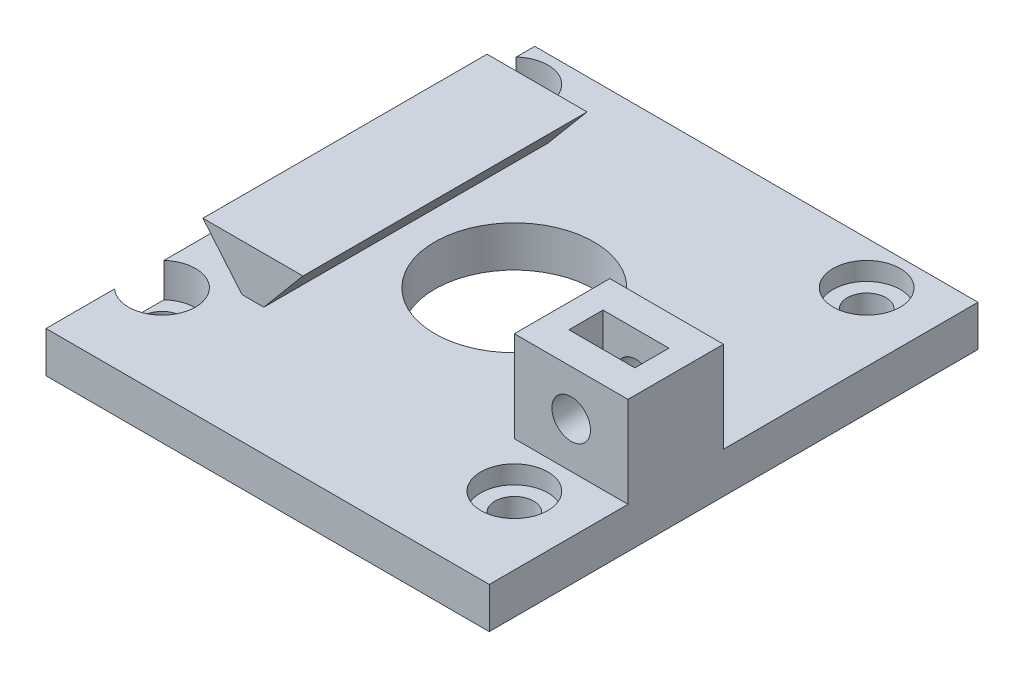
ISO-10303-21;
HEADER;
FILE_DESCRIPTION(('STEP AP214'),'2;1');
FILE_NAME('part.step','',(''),(''),'','','');
FILE_SCHEMA(('AUTOMOTIVE_DESIGN { 1 0 10303 214 1 1 1 1 }'));
ENDSEC;
DATA;
#1=APPLICATION_CONTEXT('core data for automotive mechanical design processes');
#2=APPLICATION_PROTOCOL_DEFINITION('international standard','automotive_design',2000,#1);
#3=PRODUCT_CONTEXT('',#1,'mechanical');
#4=PRODUCT('Part','Part','',(#3));
#5=PRODUCT_RELATED_PRODUCT_CATEGORY('part','',(#4));
#6=PRODUCT_DEFINITION_FORMATION('','',#4);
#7=PRODUCT_DEFINITION_CONTEXT('part definition',#1,'design');
#8=PRODUCT_DEFINITION('design','',#6,#7);
#9=PRODUCT_DEFINITION_SHAPE('','',#8);
#10=(LENGTH_UNIT() NAMED_UNIT(*) SI_UNIT(.MILLI.,.METRE.));
#11=(NAMED_UNIT(*) PLANE_ANGLE_UNIT() SI_UNIT($,.RADIAN.));
#12=(NAMED_UNIT(*) SI_UNIT($,.STERADIAN.) SOLID_ANGLE_UNIT());
#13=UNCERTAINTY_MEASURE_WITH_UNIT(LENGTH_MEASURE(1.E-05),#10,'distance_accuracy_value','');
#14=(GEOMETRIC_REPRESENTATION_CONTEXT(3) GLOBAL_UNCERTAINTY_ASSIGNED_CONTEXT((#13)) GLOBAL_UNIT_ASSIGNED_CONTEXT((#10,
#11,#12)) REPRESENTATION_CONTEXT('',''));
#15=CARTESIAN_POINT('',(0.,0.,0.));
#16=DIRECTION('',(0.,0.,1.));
#17=DIRECTION('',(1.,0.,0.));
#18=AXIS2_PLACEMENT_3D('',#15,#16,#17);
#19=CARTESIAN_POINT('',(-15.5,3.6,-15.5));
#20=DIRECTION('',(0.,-1.,0.));
#21=DIRECTION('',(0.,0.,-1.));
#22=AXIS2_PLACEMENT_3D('',#19,#20,#21);
#23=CYLINDRICAL_SURFACE('',#22,1.7);
#24=CARTESIAN_POINT('',(-15.5,0.,-15.5));
#25=DIRECTION('',(0.,1.,0.));
#26=DIRECTION('',(0.,0.,1.));
#27=AXIS2_PLACEMENT_3D('',#24,#25,#26);
#28=CIRCLE('',#27,1.7);
#29=CARTESIAN_POINT('',(-15.5,0.,-13.8));
#30=VERTEX_POINT('',#29);
#31=EDGE_CURVE('E374',#30,#30,#28,.T.);
#32=ORIENTED_EDGE('',*,*,#31,.F.);
#33=EDGE_LOOP('',(#32));
#34=FACE_BOUND('',#33,.T.);
#35=CARTESIAN_POINT('',(-15.5,0.6,-15.5));
#36=DIRECTION('',(0.,1.,0.));
#37=DIRECTION('',(0.,0.,1.));
#38=AXIS2_PLACEMENT_3D('',#35,#36,#37);
#39=CIRCLE('',#38,1.7);
#40=CARTESIAN_POINT('',(-15.5,0.6,-13.8));
#41=VERTEX_POINT('',#40);
#42=EDGE_CURVE('E206',#41,#41,#39,.T.);
#43=ORIENTED_EDGE('',*,*,#42,.T.);
#44=EDGE_LOOP('',(#43));
#45=FACE_BOUND('',#44,.T.);
#46=ADVANCED_FACE('F38',(#34,#45),#23,.F.);
#47=CARTESIAN_POINT('',(-15.5,3.6,15.5));
#48=DIRECTION('',(0.,-1.,0.));
#49=DIRECTION('',(0.,0.,-1.));
#50=AXIS2_PLACEMENT_3D('',#47,#48,#49);
#51=CYLINDRICAL_SURFACE('',#50,1.7);
#52=CARTESIAN_POINT('',(-15.5,0.,15.5));
#53=DIRECTION('',(0.,1.,0.));
#54=DIRECTION('',(0.,0.,1.));
#55=AXIS2_PLACEMENT_3D('',#52,#53,#54);
#56=CIRCLE('',#55,1.7);
#57=CARTESIAN_POINT('',(-15.5,0.,17.2));
#58=VERTEX_POINT('',#57);
#59=EDGE_CURVE('E365',#58,#58,#56,.T.);
#60=ORIENTED_EDGE('',*,*,#59,.F.);
#61=EDGE_LOOP('',(#60));
#62=FACE_BOUND('',#61,.T.);
#63=CARTESIAN_POINT('',(-15.5,0.6,15.5));
#64=DIRECTION('',(0.,1.,0.));
#65=DIRECTION('',(0.,0.,1.));
#66=AXIS2_PLACEMENT_3D('',#63,#64,#65);
#67=CIRCLE('',#66,1.7);
#68=CARTESIAN_POINT('',(-15.5,0.6,17.2));
#69=VERTEX_POINT('',#68);
#70=EDGE_CURVE('E210',#69,#69,#67,.T.);
#71=ORIENTED_EDGE('',*,*,#70,.T.);
#72=EDGE_LOOP('',(#71));
#73=FACE_BOUND('',#72,.T.);
#74=ADVANCED_FACE('F502',(#62,#73),#51,.F.);
#75=CARTESIAN_POINT('',(16.5,7.6,0.5));
#76=DIRECTION('',(0.,0.,1.));
#77=DIRECTION('',(1.,0.,0.));
#78=AXIS2_PLACEMENT_3D('',#75,#76,#77);
#79=CYLINDRICAL_SURFACE('',#78,1.7);
#80=CARTESIAN_POINT('',(16.5,7.6,3.1));
#81=DIRECTION('',(0.,0.,1.));
#82=DIRECTION('',(1.,0.,0.));
#83=AXIS2_PLACEMENT_3D('',#80,#81,#82);
#84=CIRCLE('',#83,1.7);
#85=CARTESIAN_POINT('',(18.2,7.6,3.1));
#86=VERTEX_POINT('',#85);
#87=EDGE_CURVE('E297',#86,#86,#84,.T.);
#88=ORIENTED_EDGE('',*,*,#87,.F.);
#89=EDGE_LOOP('',(#88));
#90=FACE_BOUND('',#89,.T.);
#91=CARTESIAN_POINT('',(16.5,7.6,5.8));
#92=DIRECTION('',(0.,0.,1.));
#93=DIRECTION('',(1.,0.,0.));
#94=AXIS2_PLACEMENT_3D('',#91,#92,#93);
#95=CIRCLE('',#94,1.7);
#96=CARTESIAN_POINT('',(18.2,7.6,5.8));
#97=VERTEX_POINT('',#96);
#98=EDGE_CURVE('E284',#97,#97,#95,.F.);
#99=ORIENTED_EDGE('',*,*,#98,.F.);
#100=EDGE_LOOP('',(#99));
#101=FACE_BOUND('',#100,.T.);
#102=ADVANCED_FACE('F508',(#90,#101),#79,.F.);
#103=CARTESIAN_POINT('',(15.5,3.6,-15.5));
#104=DIRECTION('',(0.,-1.,0.));
#105=DIRECTION('',(0.,0.,-1.));
#106=AXIS2_PLACEMENT_3D('',#103,#104,#105);
#107=CYLINDRICAL_SURFACE('',#106,1.7);
#108=CARTESIAN_POINT('',(15.5,0.,-15.5));
#109=DIRECTION('',(0.,1.,0.));
#110=DIRECTION('',(0.,0.,1.));
#111=AXIS2_PLACEMENT_3D('',#108,#109,#110);
#112=CIRCLE('',#111,1.7);
#113=CARTESIAN_POINT('',(15.5,0.,-13.8));
#114=VERTEX_POINT('',#113);
#115=EDGE_CURVE('E370',#114,#114,#112,.T.);
#116=ORIENTED_EDGE('',*,*,#115,.F.);
#117=EDGE_LOOP('',(#116));
#118=FACE_BOUND('',#117,.T.);
#119=CARTESIAN_POINT('',(15.5,2.,-15.5));
#120=DIRECTION('',(0.,1.,0.));
#121=DIRECTION('',(0.,0.,1.));
#122=AXIS2_PLACEMENT_3D('',#119,#120,#121);
#123=CIRCLE('',#122,1.7);
#124=CARTESIAN_POINT('',(15.5,2.,-13.8));
#125=VERTEX_POINT('',#124);
#126=EDGE_CURVE('E366',#125,#125,#123,.T.);
#127=ORIENTED_EDGE('',*,*,#126,.T.);
#128=EDGE_LOOP('',(#127));
#129=FACE_BOUND('',#128,.T.);
#130=ADVANCED_FACE('F515',(#118,#129),#107,.F.);
#131=CARTESIAN_POINT('',(15.5,3.6,15.5));
#132=DIRECTION('',(0.,-1.,0.));
#133=DIRECTION('',(0.,0.,-1.));
#134=AXIS2_PLACEMENT_3D('',#131,#132,#133);
#135=CYLINDRICAL_SURFACE('',#134,1.7);
#136=CARTESIAN_POINT('',(15.5,0.,15.5));
#137=DIRECTION('',(0.,1.,0.));
#138=DIRECTION('',(0.,0.,1.));
#139=AXIS2_PLACEMENT_3D('',#136,#137,#138);
#140=CIRCLE('',#139,1.7);
#141=CARTESIAN_POINT('',(15.5,0.,17.2));
#142=VERTEX_POINT('',#141);
#143=EDGE_CURVE('E361',#142,#142,#140,.T.);
#144=ORIENTED_EDGE('',*,*,#143,.F.);
#145=EDGE_LOOP('',(#144));
#146=FACE_BOUND('',#145,.T.);
#147=CARTESIAN_POINT('',(15.5,2.,15.5));
#148=DIRECTION('',(0.,1.,0.));
#149=DIRECTION('',(0.,0.,1.));
#150=AXIS2_PLACEMENT_3D('',#147,#148,#149);
#151=CIRCLE('',#150,1.7);
#152=CARTESIAN_POINT('',(15.5,2.,17.2));
#153=VERTEX_POINT('',#152);
#154=EDGE_CURVE('E360',#153,#153,#151,.T.);
#155=ORIENTED_EDGE('',*,*,#154,.T.);
#156=EDGE_LOOP('',(#155));
#157=FACE_BOUND('',#156,.T.);
#158=ADVANCED_FACE('F525',(#146,#157),#135,.F.);
#159=CARTESIAN_POINT('',(0.,3.6,0.));
#160=DIRECTION('',(0.,1.,0.));
#161=DIRECTION('',(0.,0.,1.));
#162=AXIS2_PLACEMENT_3D('',#159,#160,#161);
#163=PLANE('',#162);
#164=DIRECTION('',(-1.,0.,0.));
#165=VECTOR('',#164,1.);
#166=CARTESIAN_POINT('',(0.,3.6,-12.5));
#167=LINE('',#166,#165);
#168=CARTESIAN_POINT('',(-9.54030848782689,3.6,-12.5));
#169=VERTEX_POINT('',#168);
#170=CARTESIAN_POINT('',(-11.4596915121731,3.6,-12.5));
#171=VERTEX_POINT('',#170);
#172=EDGE_CURVE('E11',#169,#171,#167,.T.);
#173=ORIENTED_EDGE('',*,*,#172,.F.);
#174=DIRECTION('',(0.,0.,-1.));
#175=VECTOR('',#174,1.);
#176=CARTESIAN_POINT('',(-9.54030848782689,3.6,0.));
#177=LINE('',#176,#175);
#178=CARTESIAN_POINT('',(-9.54030848782689,3.6,12.5));
#179=VERTEX_POINT('',#178);
#180=EDGE_CURVE('E47',#179,#169,#177,.T.);
#181=ORIENTED_EDGE('',*,*,#180,.F.);
#182=DIRECTION('',(-1.,0.,0.));
#183=VECTOR('',#182,1.);
#184=CARTESIAN_POINT('',(0.,3.6,12.5));
#185=LINE('',#184,#183);
#186=CARTESIAN_POINT('',(-11.4596915121731,3.6,12.5));
#187=VERTEX_POINT('',#186);
#188=EDGE_CURVE('E462',#179,#187,#185,.T.);
#189=ORIENTED_EDGE('',*,*,#188,.T.);
#190=DIRECTION('',(0.,0.,1.));
#191=VECTOR('',#190,1.);
#192=CARTESIAN_POINT('',(-11.4596915121731,3.6,0.));
#193=LINE('',#192,#191);
#194=EDGE_CURVE('E466',#171,#187,#193,.T.);
#195=ORIENTED_EDGE('',*,*,#194,.F.);
#196=EDGE_LOOP('',(#173,#181,#189,#195));
#197=FACE_BOUND('',#196,.T.);
#198=DIRECTION('',(-1.,0.,0.));
#199=VECTOR('',#198,1.);
#200=CARTESIAN_POINT('',(21.5,3.6,3.1));
#201=LINE('',#200,#199);
#202=CARTESIAN_POINT('',(21.5,3.6,3.1));
#203=VERTEX_POINT('',#202);
#204=CARTESIAN_POINT('',(11.5,3.6,3.1));
#205=VERTEX_POINT('',#204);
#206=EDGE_CURVE('E303',#203,#205,#201,.T.);
#207=ORIENTED_EDGE('',*,*,#206,.F.);
#208=DIRECTION('',(0.,0.,-1.));
#209=VECTOR('',#208,1.);
#210=CARTESIAN_POINT('',(21.5,3.6,23.7051282051282));
#211=LINE('',#210,#209);
#212=CARTESIAN_POINT('',(21.5,3.6,-19.2948717948718));
#213=VERTEX_POINT('',#212);
#214=EDGE_CURVE('E396',#203,#213,#211,.T.);
#215=ORIENTED_EDGE('',*,*,#214,.T.);
#216=DIRECTION('',(-1.,0.,0.));
#217=VECTOR('',#216,1.);
#218=CARTESIAN_POINT('',(21.5,3.6,-19.2948717948718));
#219=LINE('',#218,#217);
#220=CARTESIAN_POINT('',(-17.5,3.6,-19.2948717948718));
#221=VERTEX_POINT('',#220);
#222=EDGE_CURVE('E400',#213,#221,#219,.T.);
#223=ORIENTED_EDGE('',*,*,#222,.T.);
#224=DIRECTION('',(0.,0.,1.));
#225=VECTOR('',#224,1.);
#226=CARTESIAN_POINT('',(-17.5,3.6,23.7051282051282));
#227=LINE('',#226,#225);
#228=CARTESIAN_POINT('',(-17.5,3.6,-17.6685248442201));
#229=VERTEX_POINT('',#228);
#230=EDGE_CURVE('E387',#221,#229,#227,.T.);
#231=ORIENTED_EDGE('',*,*,#230,.T.);
#232=CARTESIAN_POINT('',(-15.5,3.6,-15.5));
#233=DIRECTION('',(0.,1.,0.));
#234=DIRECTION('',(0.,0.,1.));
#235=AXIS2_PLACEMENT_3D('',#232,#233,#234);
#236=CIRCLE('',#235,2.95);
#237=CARTESIAN_POINT('',(-17.5,3.6,-13.3314751557799));
#238=VERTEX_POINT('',#237);
#239=EDGE_CURVE('E351',#238,#229,#236,.T.);
#240=ORIENTED_EDGE('',*,*,#239,.F.);
#241=CARTESIAN_POINT('',(-17.5,3.6,13.3314751557799));
#242=VERTEX_POINT('',#241);
#243=EDGE_CURVE('E392',#238,#242,#227,.T.);
#244=ORIENTED_EDGE('',*,*,#243,.T.);
#245=CARTESIAN_POINT('',(-15.5,3.6,15.5));
#246=DIRECTION('',(0.,1.,0.));
#247=DIRECTION('',(0.,0.,1.));
#248=AXIS2_PLACEMENT_3D('',#245,#246,#247);
#249=CIRCLE('',#248,2.95);
#250=CARTESIAN_POINT('',(-17.5,3.6,17.6685248442202));
#251=VERTEX_POINT('',#250);
#252=EDGE_CURVE('E189',#251,#242,#249,.T.);
#253=ORIENTED_EDGE('',*,*,#252,.F.);
#254=CARTESIAN_POINT('',(-17.5,3.6,23.7051282051282));
#255=VERTEX_POINT('',#254);
#256=EDGE_CURVE('E393',#251,#255,#227,.T.);
#257=ORIENTED_EDGE('',*,*,#256,.T.);
#258=DIRECTION('',(1.,0.,0.));
#259=VECTOR('',#258,1.);
#260=CARTESIAN_POINT('',(21.5,3.6,23.7051282051282));
#261=LINE('',#260,#259);
#262=CARTESIAN_POINT('',(21.5,3.6,23.7051282051282));
#263=VERTEX_POINT('',#262);
#264=EDGE_CURVE('E391',#255,#263,#261,.T.);
#265=ORIENTED_EDGE('',*,*,#264,.T.);
#266=CARTESIAN_POINT('',(21.5,3.6,11.5));
#267=VERTEX_POINT('',#266);
#268=EDGE_CURVE('E397',#263,#267,#211,.T.);
#269=ORIENTED_EDGE('',*,*,#268,.T.);
#270=DIRECTION('',(1.,0.,0.));
#271=VECTOR('',#270,1.);
#272=CARTESIAN_POINT('',(21.5,3.6,11.5));
#273=LINE('',#272,#271);
#274=CARTESIAN_POINT('',(11.5,3.6,11.5));
#275=VERTEX_POINT('',#274);
#276=EDGE_CURVE('E317',#275,#267,#273,.T.);
#277=ORIENTED_EDGE('',*,*,#276,.F.);
#278=DIRECTION('',(0.,0.,1.));
#279=VECTOR('',#278,1.);
#280=CARTESIAN_POINT('',(11.5,3.6,11.5));
#281=LINE('',#280,#279);
#282=EDGE_CURVE('E313',#205,#275,#281,.T.);
#283=ORIENTED_EDGE('',*,*,#282,.F.);
#284=EDGE_LOOP('',(#207,#215,#223,#231,#240,#244,#253,#257,#265,#269,#277,#283));
#285=FACE_BOUND('',#284,.T.);
#286=CARTESIAN_POINT('',(15.5,3.6,-15.5));
#287=DIRECTION('',(0.,1.,0.));
#288=DIRECTION('',(0.,0.,1.));
#289=AXIS2_PLACEMENT_3D('',#286,#287,#288);
#290=CIRCLE('',#289,2.95);
#291=CARTESIAN_POINT('',(15.5,3.6,-12.55));
#292=VERTEX_POINT('',#291);
#293=EDGE_CURVE('E352',#292,#292,#290,.T.);
#294=ORIENTED_EDGE('',*,*,#293,.F.);
#295=EDGE_LOOP('',(#294));
#296=FACE_BOUND('',#295,.T.);
#297=CARTESIAN_POINT('',(15.5,3.6,15.5));
#298=DIRECTION('',(0.,1.,0.));
#299=DIRECTION('',(0.,0.,1.));
#300=AXIS2_PLACEMENT_3D('',#297,#298,#299);
#301=CIRCLE('',#300,2.95);
#302=CARTESIAN_POINT('',(15.5,3.6,18.45));
#303=VERTEX_POINT('',#302);
#304=EDGE_CURVE('E339',#303,#303,#301,.T.);
#305=ORIENTED_EDGE('',*,*,#304,.F.);
#306=EDGE_LOOP('',(#305));
#307=FACE_BOUND('',#306,.T.);
#308=CARTESIAN_POINT('',(0.,3.6,0.));
#309=DIRECTION('',(0.,1.,0.));
#310=DIRECTION('',(0.,0.,1.));
#311=AXIS2_PLACEMENT_3D('',#308,#309,#310);
#312=CIRCLE('',#311,7.);
#313=CARTESIAN_POINT('',(0.,3.6,7.));
#314=VERTEX_POINT('',#313);
#315=EDGE_CURVE('E379',#314,#314,#312,.T.);
#316=ORIENTED_EDGE('',*,*,#315,.F.);
#317=EDGE_LOOP('',(#316));
#318=FACE_BOUND('',#317,.T.);
#319=ADVANCED_FACE('F482',(#197,#285,#296,#307,#318),#163,.T.);
#320=CARTESIAN_POINT('',(0.,0.,0.));
#321=DIRECTION('',(0.,1.,0.));
#322=DIRECTION('',(0.,0.,1.));
#323=AXIS2_PLACEMENT_3D('',#320,#321,#322);
#324=PLANE('',#323);
#325=DIRECTION('',(0.,0.,1.));
#326=VECTOR('',#325,1.);
#327=CARTESIAN_POINT('',(-17.5,0.,23.7051282051282));
#328=LINE('',#327,#326);
#329=CARTESIAN_POINT('',(-17.5,0.,-19.2948717948718));
#330=VERTEX_POINT('',#329);
#331=CARTESIAN_POINT('',(-17.5,0.,23.7051282051282));
#332=VERTEX_POINT('',#331);
#333=EDGE_CURVE('E383',#330,#332,#328,.T.);
#334=ORIENTED_EDGE('',*,*,#333,.F.);
#335=DIRECTION('',(-1.,0.,0.));
#336=VECTOR('',#335,1.);
#337=CARTESIAN_POINT('',(21.5,0.,-19.2948717948718));
#338=LINE('',#337,#336);
#339=CARTESIAN_POINT('',(21.5,0.,-19.2948717948718));
#340=VERTEX_POINT('',#339);
#341=EDGE_CURVE('E413',#340,#330,#338,.T.);
#342=ORIENTED_EDGE('',*,*,#341,.F.);
#343=DIRECTION('',(0.,0.,-1.));
#344=VECTOR('',#343,1.);
#345=CARTESIAN_POINT('',(21.5,0.,23.7051282051282));
#346=LINE('',#345,#344);
#347=CARTESIAN_POINT('',(21.5,0.,23.7051282051282));
#348=VERTEX_POINT('',#347);
#349=EDGE_CURVE('E410',#348,#340,#346,.T.);
#350=ORIENTED_EDGE('',*,*,#349,.F.);
#351=DIRECTION('',(1.,0.,0.));
#352=VECTOR('',#351,1.);
#353=CARTESIAN_POINT('',(21.5,0.,23.7051282051282));
#354=LINE('',#353,#352);
#355=EDGE_CURVE('E407',#332,#348,#354,.T.);
#356=ORIENTED_EDGE('',*,*,#355,.F.);
#357=EDGE_LOOP('',(#334,#342,#350,#356));
#358=FACE_BOUND('',#357,.T.);
#359=CARTESIAN_POINT('',(0.,0.,0.));
#360=DIRECTION('',(0.,1.,0.));
#361=DIRECTION('',(0.,0.,1.));
#362=AXIS2_PLACEMENT_3D('',#359,#360,#361);
#363=CIRCLE('',#362,7.);
#364=CARTESIAN_POINT('',(0.,0.,7.));
#365=VERTEX_POINT('',#364);
#366=EDGE_CURVE('E378',#365,#365,#363,.T.);
#367=ORIENTED_EDGE('',*,*,#366,.T.);
#368=EDGE_LOOP('',(#367));
#369=FACE_BOUND('',#368,.T.);
#370=ORIENTED_EDGE('',*,*,#31,.T.);
#371=EDGE_LOOP('',(#370));
#372=FACE_BOUND('',#371,.T.);
#373=ORIENTED_EDGE('',*,*,#115,.T.);
#374=EDGE_LOOP('',(#373));
#375=FACE_BOUND('',#374,.T.);
#376=ORIENTED_EDGE('',*,*,#59,.T.);
#377=EDGE_LOOP('',(#376));
#378=FACE_BOUND('',#377,.T.);
#379=ORIENTED_EDGE('',*,*,#143,.T.);
#380=EDGE_LOOP('',(#379));
#381=FACE_BOUND('',#380,.T.);
#382=ADVANCED_FACE('F524',(#358,#369,#372,#375,#378,#381),#324,.F.);
#383=CARTESIAN_POINT('',(-17.5,3.6,23.7051282051282));
#384=DIRECTION('',(1.,0.,0.));
#385=DIRECTION('',(0.,0.,-1.));
#386=AXIS2_PLACEMENT_3D('',#383,#384,#385);
#387=PLANE('',#386);
#388=DIRECTION('',(0.,0.,1.));
#389=VECTOR('',#388,1.);
#390=CARTESIAN_POINT('',(-17.5,0.6,13.3314751557799));
#391=LINE('',#390,#389);
#392=CARTESIAN_POINT('',(-17.5,0.6,13.3314751557799));
#393=VERTEX_POINT('',#392);
#394=CARTESIAN_POINT('',(-17.5,0.6,17.6685248442202));
#395=VERTEX_POINT('',#394);
#396=EDGE_CURVE('E200',#393,#395,#391,.T.);
#397=ORIENTED_EDGE('',*,*,#396,.F.);
#398=DIRECTION('',(0.,1.,0.));
#399=VECTOR('',#398,1.);
#400=CARTESIAN_POINT('',(-17.5,2.,13.3314751557799));
#401=LINE('',#400,#399);
#402=EDGE_CURVE('E183',#393,#242,#401,.T.);
#403=ORIENTED_EDGE('',*,*,#402,.T.);
#404=ORIENTED_EDGE('',*,*,#243,.F.);
#405=DIRECTION('',(0.,1.,0.));
#406=VECTOR('',#405,1.);
#407=CARTESIAN_POINT('',(-17.5,2.,-13.3314751557799));
#408=LINE('',#407,#406);
#409=CARTESIAN_POINT('',(-17.5,0.6,-13.3314751557799));
#410=VERTEX_POINT('',#409);
#411=EDGE_CURVE('E431',#238,#410,#408,.F.);
#412=ORIENTED_EDGE('',*,*,#411,.T.);
#413=DIRECTION('',(0.,0.,1.));
#414=VECTOR('',#413,1.);
#415=CARTESIAN_POINT('',(-17.5,0.6,-17.6685248442201));
#416=LINE('',#415,#414);
#417=CARTESIAN_POINT('',(-17.5,0.6,-17.6685248442201));
#418=VERTEX_POINT('',#417);
#419=EDGE_CURVE('E202',#418,#410,#416,.T.);
#420=ORIENTED_EDGE('',*,*,#419,.F.);
#421=DIRECTION('',(0.,1.,0.));
#422=VECTOR('',#421,1.);
#423=CARTESIAN_POINT('',(-17.5,2.,-17.6685248442201));
#424=LINE('',#423,#422);
#425=EDGE_CURVE('E440',#418,#229,#424,.T.);
#426=ORIENTED_EDGE('',*,*,#425,.T.);
#427=ORIENTED_EDGE('',*,*,#230,.F.);
#428=DIRECTION('',(0.,-1.,0.));
#429=VECTOR('',#428,1.);
#430=CARTESIAN_POINT('',(-17.5,3.6,-19.2948717948718));
#431=LINE('',#430,#429);
#432=EDGE_CURVE('E403',#221,#330,#431,.T.);
#433=ORIENTED_EDGE('',*,*,#432,.T.);
#434=ORIENTED_EDGE('',*,*,#333,.T.);
#435=DIRECTION('',(0.,-1.,0.));
#436=VECTOR('',#435,1.);
#437=CARTESIAN_POINT('',(-17.5,3.6,23.7051282051282));
#438=LINE('',#437,#436);
#439=EDGE_CURVE('E427',#255,#332,#438,.T.);
#440=ORIENTED_EDGE('',*,*,#439,.F.);
#441=ORIENTED_EDGE('',*,*,#256,.F.);
#442=DIRECTION('',(0.,1.,0.));
#443=VECTOR('',#442,1.);
#444=CARTESIAN_POINT('',(-17.5,2.,17.6685248442202));
#445=LINE('',#444,#443);
#446=EDGE_CURVE('E196',#251,#395,#445,.F.);
#447=ORIENTED_EDGE('',*,*,#446,.T.);
#448=EDGE_LOOP('',(#397,#403,#404,#412,#420,#426,#427,#433,#434,#440,#441,#447));
#449=FACE_BOUND('',#448,.T.);
#450=ADVANCED_FACE('F40',(#449),#387,.F.);
#451=CARTESIAN_POINT('',(21.5,3.6,23.7051282051282));
#452=DIRECTION('',(0.,0.,-1.));
#453=DIRECTION('',(-1.,0.,0.));
#454=AXIS2_PLACEMENT_3D('',#451,#452,#453);
#455=PLANE('',#454);
#456=ORIENTED_EDGE('',*,*,#355,.T.);
#457=DIRECTION('',(0.,-1.,0.));
#458=VECTOR('',#457,1.);
#459=CARTESIAN_POINT('',(21.5,3.6,23.7051282051282));
#460=LINE('',#459,#458);
#461=EDGE_CURVE('E423',#263,#348,#460,.T.);
#462=ORIENTED_EDGE('',*,*,#461,.F.);
#463=ORIENTED_EDGE('',*,*,#264,.F.);
#464=ORIENTED_EDGE('',*,*,#439,.T.);
#465=EDGE_LOOP('',(#456,#462,#463,#464));
#466=FACE_BOUND('',#465,.T.);
#467=ADVANCED_FACE('F534',(#466),#455,.F.);
#468=CARTESIAN_POINT('',(21.5,3.6,23.7051282051282));
#469=DIRECTION('',(-1.,0.,0.));
#470=DIRECTION('',(0.,0.,1.));
#471=AXIS2_PLACEMENT_3D('',#468,#469,#470);
#472=PLANE('',#471);
#473=ORIENTED_EDGE('',*,*,#349,.T.);
#474=DIRECTION('',(0.,-1.,0.));
#475=VECTOR('',#474,1.);
#476=CARTESIAN_POINT('',(21.5,3.6,-19.2948717948718));
#477=LINE('',#476,#475);
#478=EDGE_CURVE('E419',#213,#340,#477,.T.);
#479=ORIENTED_EDGE('',*,*,#478,.F.);
#480=ORIENTED_EDGE('',*,*,#214,.F.);
#481=DIRECTION('',(0.,-1.,0.));
#482=VECTOR('',#481,1.);
#483=CARTESIAN_POINT('',(21.5,11.6,3.1));
#484=LINE('',#483,#482);
#485=CARTESIAN_POINT('',(21.5,11.6,3.1));
#486=VERTEX_POINT('',#485);
#487=EDGE_CURVE('E327',#486,#203,#484,.T.);
#488=ORIENTED_EDGE('',*,*,#487,.F.);
#489=DIRECTION('',(0.,0.,-1.));
#490=VECTOR('',#489,1.);
#491=CARTESIAN_POINT('',(21.5,11.6,11.5));
#492=LINE('',#491,#490);
#493=CARTESIAN_POINT('',(21.5,11.6,11.5));
#494=VERTEX_POINT('',#493);
#495=EDGE_CURVE('E306',#494,#486,#492,.T.);
#496=ORIENTED_EDGE('',*,*,#495,.F.);
#497=DIRECTION('',(0.,-1.,0.));
#498=VECTOR('',#497,1.);
#499=CARTESIAN_POINT('',(21.5,11.6,11.5));
#500=LINE('',#499,#498);
#501=EDGE_CURVE('E331',#494,#267,#500,.T.);
#502=ORIENTED_EDGE('',*,*,#501,.T.);
#503=ORIENTED_EDGE('',*,*,#268,.F.);
#504=ORIENTED_EDGE('',*,*,#461,.T.);
#505=EDGE_LOOP('',(#473,#479,#480,#488,#496,#502,#503,#504));
#506=FACE_BOUND('',#505,.T.);
#507=ADVANCED_FACE('F531',(#506),#472,.F.);
#508=CARTESIAN_POINT('',(21.5,3.6,-19.2948717948718));
#509=DIRECTION('',(0.,0.,1.));
#510=DIRECTION('',(1.,0.,0.));
#511=AXIS2_PLACEMENT_3D('',#508,#509,#510);
#512=PLANE('',#511);
#513=ORIENTED_EDGE('',*,*,#341,.T.);
#514=ORIENTED_EDGE('',*,*,#432,.F.);
#515=ORIENTED_EDGE('',*,*,#222,.F.);
#516=ORIENTED_EDGE('',*,*,#478,.T.);
#517=EDGE_LOOP('',(#513,#514,#515,#516));
#518=FACE_BOUND('',#517,.T.);
#519=ADVANCED_FACE('F520',(#518),#512,.F.);
#520=CARTESIAN_POINT('',(0.,3.6,0.));
#521=DIRECTION('',(0.,-1.,0.));
#522=DIRECTION('',(0.,0.,-1.));
#523=AXIS2_PLACEMENT_3D('',#520,#521,#522);
#524=CYLINDRICAL_SURFACE('',#523,7.);
#525=ORIENTED_EDGE('',*,*,#315,.T.);
#526=EDGE_LOOP('',(#525));
#527=FACE_BOUND('',#526,.T.);
#528=ORIENTED_EDGE('',*,*,#366,.F.);
#529=EDGE_LOOP('',(#528));
#530=FACE_BOUND('',#529,.T.);
#531=ADVANCED_FACE('F516',(#527,#530),#524,.F.);
#532=CARTESIAN_POINT('',(15.5,2.,15.5));
#533=DIRECTION('',(0.,1.,0.));
#534=DIRECTION('',(0.,0.,1.));
#535=AXIS2_PLACEMENT_3D('',#532,#533,#534);
#536=CYLINDRICAL_SURFACE('',#535,2.95);
#537=CARTESIAN_POINT('',(15.5,2.,15.5));
#538=DIRECTION('',(0.,1.,0.));
#539=DIRECTION('',(0.,0.,1.));
#540=AXIS2_PLACEMENT_3D('',#537,#538,#539);
#541=CIRCLE('',#540,2.95);
#542=CARTESIAN_POINT('',(15.5,2.,18.45));
#543=VERTEX_POINT('',#542);
#544=EDGE_CURVE('E340',#543,#543,#541,.T.);
#545=ORIENTED_EDGE('',*,*,#544,.F.);
#546=EDGE_LOOP('',(#545));
#547=FACE_BOUND('',#546,.T.);
#548=ORIENTED_EDGE('',*,*,#304,.T.);
#549=EDGE_LOOP('',(#548));
#550=FACE_BOUND('',#549,.T.);
#551=ADVANCED_FACE('F519',(#547,#550),#536,.F.);
#552=CARTESIAN_POINT('',(15.5,2.,15.5));
#553=DIRECTION('',(0.,1.,0.));
#554=DIRECTION('',(0.,0.,1.));
#555=AXIS2_PLACEMENT_3D('',#552,#553,#554);
#556=PLANE('',#555);
#557=ORIENTED_EDGE('',*,*,#154,.F.);
#558=EDGE_LOOP('',(#557));
#559=FACE_BOUND('',#558,.T.);
#560=ORIENTED_EDGE('',*,*,#544,.T.);
#561=EDGE_LOOP('',(#560));
#562=FACE_BOUND('',#561,.T.);
#563=ADVANCED_FACE('F594',(#559,#562),#556,.T.);
#564=CARTESIAN_POINT('',(-15.5,2.,15.5));
#565=DIRECTION('',(0.,1.,0.));
#566=DIRECTION('',(0.,0.,1.));
#567=AXIS2_PLACEMENT_3D('',#564,#565,#566);
#568=CYLINDRICAL_SURFACE('',#567,2.95);
#569=ORIENTED_EDGE('',*,*,#402,.F.);
#570=CARTESIAN_POINT('',(-15.5,0.6,15.5));
#571=DIRECTION('',(0.,1.,0.));
#572=DIRECTION('',(0.,0.,1.));
#573=AXIS2_PLACEMENT_3D('',#570,#571,#572);
#574=CIRCLE('',#573,2.95);
#575=EDGE_CURVE('E186',#395,#393,#574,.T.);
#576=ORIENTED_EDGE('',*,*,#575,.F.);
#577=ORIENTED_EDGE('',*,*,#446,.F.);
#578=ORIENTED_EDGE('',*,*,#252,.T.);
#579=EDGE_LOOP('',(#569,#576,#577,#578));
#580=FACE_BOUND('',#579,.T.);
#581=ADVANCED_FACE('F185',(#580),#568,.F.);
#582=CARTESIAN_POINT('',(15.5,2.,-15.5));
#583=DIRECTION('',(0.,1.,0.));
#584=DIRECTION('',(0.,0.,1.));
#585=AXIS2_PLACEMENT_3D('',#582,#583,#584);
#586=CYLINDRICAL_SURFACE('',#585,2.95);
#587=CARTESIAN_POINT('',(15.5,2.,-15.5));
#588=DIRECTION('',(0.,1.,0.));
#589=DIRECTION('',(0.,0.,1.));
#590=AXIS2_PLACEMENT_3D('',#587,#588,#589);
#591=CIRCLE('',#590,2.95);
#592=CARTESIAN_POINT('',(15.5,2.,-12.55));
#593=VERTEX_POINT('',#592);
#594=EDGE_CURVE('E347',#593,#593,#591,.T.);
#595=ORIENTED_EDGE('',*,*,#594,.F.);
#596=EDGE_LOOP('',(#595));
#597=FACE_BOUND('',#596,.T.);
#598=ORIENTED_EDGE('',*,*,#293,.T.);
#599=EDGE_LOOP('',(#598));
#600=FACE_BOUND('',#599,.T.);
#601=ADVANCED_FACE('F578',(#597,#600),#586,.F.);
#602=CARTESIAN_POINT('',(15.5,2.,-15.5));
#603=DIRECTION('',(0.,1.,0.));
#604=DIRECTION('',(0.,0.,1.));
#605=AXIS2_PLACEMENT_3D('',#602,#603,#604);
#606=PLANE('',#605);
#607=ORIENTED_EDGE('',*,*,#126,.F.);
#608=EDGE_LOOP('',(#607));
#609=FACE_BOUND('',#608,.T.);
#610=ORIENTED_EDGE('',*,*,#594,.T.);
#611=EDGE_LOOP('',(#610));
#612=FACE_BOUND('',#611,.T.);
#613=ADVANCED_FACE('F568',(#609,#612),#606,.T.);
#614=CARTESIAN_POINT('',(-15.5,2.,-15.5));
#615=DIRECTION('',(0.,1.,0.));
#616=DIRECTION('',(0.,0.,1.));
#617=AXIS2_PLACEMENT_3D('',#614,#615,#616);
#618=CYLINDRICAL_SURFACE('',#617,2.95);
#619=ORIENTED_EDGE('',*,*,#425,.F.);
#620=CARTESIAN_POINT('',(-15.5,0.6,-15.5));
#621=DIRECTION('',(0.,1.,0.));
#622=DIRECTION('',(0.,0.,1.));
#623=AXIS2_PLACEMENT_3D('',#620,#621,#622);
#624=CIRCLE('',#623,2.95);
#625=EDGE_CURVE('E213',#410,#418,#624,.T.);
#626=ORIENTED_EDGE('',*,*,#625,.F.);
#627=ORIENTED_EDGE('',*,*,#411,.F.);
#628=ORIENTED_EDGE('',*,*,#239,.T.);
#629=EDGE_LOOP('',(#619,#626,#627,#628));
#630=FACE_BOUND('',#629,.T.);
#631=ADVANCED_FACE('F564',(#630),#618,.F.);
#632=CARTESIAN_POINT('',(11.5,11.6,11.5));
#633=DIRECTION('',(1.,0.,0.));
#634=DIRECTION('',(0.,0.,-1.));
#635=AXIS2_PLACEMENT_3D('',#632,#633,#634);
#636=PLANE('',#635);
#637=ORIENTED_EDGE('',*,*,#282,.T.);
#638=DIRECTION('',(0.,-1.,0.));
#639=VECTOR('',#638,1.);
#640=CARTESIAN_POINT('',(11.5,11.6,11.5));
#641=LINE('',#640,#639);
#642=CARTESIAN_POINT('',(11.5,11.6,11.5));
#643=VERTEX_POINT('',#642);
#644=EDGE_CURVE('E335',#643,#275,#641,.T.);
#645=ORIENTED_EDGE('',*,*,#644,.F.);
#646=DIRECTION('',(0.,0.,1.));
#647=VECTOR('',#646,1.);
#648=CARTESIAN_POINT('',(11.5,11.6,11.5));
#649=LINE('',#648,#647);
#650=CARTESIAN_POINT('',(11.5,11.6,3.1));
#651=VERTEX_POINT('',#650);
#652=EDGE_CURVE('E298',#651,#643,#649,.T.);
#653=ORIENTED_EDGE('',*,*,#652,.F.);
#654=DIRECTION('',(0.,-1.,0.));
#655=VECTOR('',#654,1.);
#656=CARTESIAN_POINT('',(11.5,11.6,3.1));
#657=LINE('',#656,#655);
#658=EDGE_CURVE('E312',#651,#205,#657,.T.);
#659=ORIENTED_EDGE('',*,*,#658,.T.);
#660=EDGE_LOOP('',(#637,#645,#653,#659));
#661=FACE_BOUND('',#660,.T.);
#662=ADVANCED_FACE('F567',(#661),#636,.F.);
#663=CARTESIAN_POINT('',(21.5,11.6,11.5));
#664=DIRECTION('',(0.,0.,-1.));
#665=DIRECTION('',(-1.,0.,0.));
#666=AXIS2_PLACEMENT_3D('',#663,#664,#665);
#667=PLANE('',#666);
#668=CARTESIAN_POINT('',(16.5,7.6,11.5));
#669=DIRECTION('',(0.,0.,1.));
#670=DIRECTION('',(1.,0.,0.));
#671=AXIS2_PLACEMENT_3D('',#668,#669,#670);
#672=CIRCLE('',#671,1.7);
#673=CARTESIAN_POINT('',(18.2,7.6,11.5));
#674=VERTEX_POINT('',#673);
#675=EDGE_CURVE('E293',#674,#674,#672,.T.);
#676=ORIENTED_EDGE('',*,*,#675,.F.);
#677=EDGE_LOOP('',(#676));
#678=FACE_BOUND('',#677,.T.);
#679=ORIENTED_EDGE('',*,*,#276,.T.);
#680=ORIENTED_EDGE('',*,*,#501,.F.);
#681=DIRECTION('',(1.,0.,0.));
#682=VECTOR('',#681,1.);
#683=CARTESIAN_POINT('',(21.5,11.6,11.5));
#684=LINE('',#683,#682);
#685=EDGE_CURVE('E302',#643,#494,#684,.T.);
#686=ORIENTED_EDGE('',*,*,#685,.F.);
#687=ORIENTED_EDGE('',*,*,#644,.T.);
#688=EDGE_LOOP('',(#679,#680,#686,#687));
#689=FACE_BOUND('',#688,.T.);
#690=ADVANCED_FACE('F574',(#678,#689),#667,.F.);
#691=CARTESIAN_POINT('',(21.5,11.6,3.1));
#692=DIRECTION('',(0.,0.,1.));
#693=DIRECTION('',(1.,0.,0.));
#694=AXIS2_PLACEMENT_3D('',#691,#692,#693);
#695=PLANE('',#694);
#696=ORIENTED_EDGE('',*,*,#87,.T.);
#697=EDGE_LOOP('',(#696));
#698=FACE_BOUND('',#697,.T.);
#699=ORIENTED_EDGE('',*,*,#206,.T.);
#700=ORIENTED_EDGE('',*,*,#658,.F.);
#701=DIRECTION('',(-1.,0.,0.));
#702=VECTOR('',#701,1.);
#703=CARTESIAN_POINT('',(21.5,11.6,3.1));
#704=LINE('',#703,#702);
#705=EDGE_CURVE('E309',#486,#651,#704,.T.);
#706=ORIENTED_EDGE('',*,*,#705,.F.);
#707=ORIENTED_EDGE('',*,*,#487,.T.);
#708=EDGE_LOOP('',(#699,#700,#706,#707));
#709=FACE_BOUND('',#708,.T.);
#710=ADVANCED_FACE('F786',(#698,#709),#695,.F.);
#711=CARTESIAN_POINT('',(0.,11.6,0.));
#712=DIRECTION('',(0.,1.,0.));
#713=DIRECTION('',(0.,0.,1.));
#714=AXIS2_PLACEMENT_3D('',#711,#712,#713);
#715=PLANE('',#714);
#716=DIRECTION('',(1.,0.,0.));
#717=VECTOR('',#716,1.);
#718=CARTESIAN_POINT('',(0.,11.6,8.8));
#719=LINE('',#718,#717);
#720=CARTESIAN_POINT('',(13.5988148973221,11.6,8.8));
#721=VERTEX_POINT('',#720);
#722=CARTESIAN_POINT('',(19.4011851026779,11.6,8.8));
#723=VERTEX_POINT('',#722);
#724=EDGE_CURVE('E290',#721,#723,#719,.T.);
#725=ORIENTED_EDGE('',*,*,#724,.F.);
#726=DIRECTION('',(0.,0.,-1.));
#727=VECTOR('',#726,1.);
#728=CARTESIAN_POINT('',(13.5988148973221,11.6,0.));
#729=LINE('',#728,#727);
#730=CARTESIAN_POINT('',(13.5988148973221,11.6,5.8));
#731=VERTEX_POINT('',#730);
#732=EDGE_CURVE('E195',#721,#731,#729,.T.);
#733=ORIENTED_EDGE('',*,*,#732,.T.);
#734=DIRECTION('',(1.,0.,0.));
#735=VECTOR('',#734,1.);
#736=CARTESIAN_POINT('',(0.,11.6,5.8));
#737=LINE('',#736,#735);
#738=CARTESIAN_POINT('',(19.4011851026779,11.6,5.8));
#739=VERTEX_POINT('',#738);
#740=EDGE_CURVE('E285',#731,#739,#737,.T.);
#741=ORIENTED_EDGE('',*,*,#740,.T.);
#742=DIRECTION('',(0.,0.,1.));
#743=VECTOR('',#742,1.);
#744=CARTESIAN_POINT('',(19.4011851026779,11.6,0.));
#745=LINE('',#744,#743);
#746=EDGE_CURVE('E458',#739,#723,#745,.T.);
#747=ORIENTED_EDGE('',*,*,#746,.T.);
#748=EDGE_LOOP('',(#725,#733,#741,#747));
#749=FACE_BOUND('',#748,.T.);
#750=ORIENTED_EDGE('',*,*,#652,.T.);
#751=ORIENTED_EDGE('',*,*,#685,.T.);
#752=ORIENTED_EDGE('',*,*,#495,.T.);
#753=ORIENTED_EDGE('',*,*,#705,.T.);
#754=EDGE_LOOP('',(#750,#751,#752,#753));
#755=FACE_BOUND('',#754,.T.);
#756=ADVANCED_FACE('F796',(#749,#755),#715,.T.);
#757=CARTESIAN_POINT('',(16.5,7.6,8.8));
#758=DIRECTION('',(0.,0.,1.));
#759=DIRECTION('',(1.,0.,0.));
#760=AXIS2_PLACEMENT_3D('',#757,#758,#759);
#761=CIRCLE('',#760,1.7);
#762=CARTESIAN_POINT('',(18.2,7.6,8.8));
#763=VERTEX_POINT('',#762);
#764=EDGE_CURVE('E289',#763,#763,#761,.F.);
#765=ORIENTED_EDGE('',*,*,#764,.T.);
#766=EDGE_LOOP('',(#765));
#767=FACE_BOUND('',#766,.T.);
#768=ORIENTED_EDGE('',*,*,#675,.T.);
#769=EDGE_LOOP('',(#768));
#770=FACE_BOUND('',#769,.T.);
#771=ADVANCED_FACE('F809',(#767,#770),#79,.F.);
#772=CARTESIAN_POINT('',(0.,0.,8.8));
#773=DIRECTION('',(0.,0.,1.));
#774=DIRECTION('',(1.,0.,0.));
#775=AXIS2_PLACEMENT_3D('',#772,#773,#774);
#776=PLANE('',#775);
#777=ORIENTED_EDGE('',*,*,#724,.T.);
#778=DIRECTION('',(0.,1.,0.));
#779=VECTOR('',#778,1.);
#780=CARTESIAN_POINT('',(19.4011851026779,5.925,8.8));
#781=LINE('',#780,#779);
#782=CARTESIAN_POINT('',(19.4011851026779,5.925,8.8));
#783=VERTEX_POINT('',#782);
#784=EDGE_CURVE('E270',#783,#723,#781,.T.);
#785=ORIENTED_EDGE('',*,*,#784,.F.);
#786=DIRECTION('',(0.866025403784439,0.5,0.));
#787=VECTOR('',#786,1.);
#788=CARTESIAN_POINT('',(16.5,4.25,8.8));
#789=LINE('',#788,#787);
#790=CARTESIAN_POINT('',(16.5,4.25,8.8));
#791=VERTEX_POINT('',#790);
#792=EDGE_CURVE('E267',#791,#783,#789,.T.);
#793=ORIENTED_EDGE('',*,*,#792,.F.);
#794=DIRECTION('',(0.866025403784439,-0.5,0.));
#795=VECTOR('',#794,1.);
#796=CARTESIAN_POINT('',(13.5988148973221,5.925,8.8));
#797=LINE('',#796,#795);
#798=CARTESIAN_POINT('',(13.5988148973221,5.925,8.8));
#799=VERTEX_POINT('',#798);
#800=EDGE_CURVE('E264',#799,#791,#797,.T.);
#801=ORIENTED_EDGE('',*,*,#800,.F.);
#802=DIRECTION('',(0.,-1.,0.));
#803=VECTOR('',#802,1.);
#804=CARTESIAN_POINT('',(13.5988148973221,9.275,8.8));
#805=LINE('',#804,#803);
#806=EDGE_CURVE('E261',#721,#799,#805,.T.);
#807=ORIENTED_EDGE('',*,*,#806,.F.);
#808=EDGE_LOOP('',(#777,#785,#793,#801,#807));
#809=FACE_BOUND('',#808,.T.);
#810=ORIENTED_EDGE('',*,*,#764,.F.);
#811=EDGE_LOOP('',(#810));
#812=FACE_BOUND('',#811,.T.);
#813=ADVANCED_FACE('F825',(#809,#812),#776,.F.);
#814=CARTESIAN_POINT('',(0.,0.,5.8));
#815=DIRECTION('',(0.,0.,1.));
#816=DIRECTION('',(1.,0.,0.));
#817=AXIS2_PLACEMENT_3D('',#814,#815,#816);
#818=PLANE('',#817);
#819=DIRECTION('',(0.,-1.,0.));
#820=VECTOR('',#819,1.);
#821=CARTESIAN_POINT('',(13.5988148973221,9.275,5.8));
#822=LINE('',#821,#820);
#823=CARTESIAN_POINT('',(13.5988148973221,5.925,5.8));
#824=VERTEX_POINT('',#823);
#825=EDGE_CURVE('E246',#731,#824,#822,.T.);
#826=ORIENTED_EDGE('',*,*,#825,.T.);
#827=DIRECTION('',(0.866025403784439,-0.5,0.));
#828=VECTOR('',#827,1.);
#829=CARTESIAN_POINT('',(13.5988148973221,5.925,5.8));
#830=LINE('',#829,#828);
#831=CARTESIAN_POINT('',(16.5,4.25,5.8));
#832=VERTEX_POINT('',#831);
#833=EDGE_CURVE('E252',#824,#832,#830,.T.);
#834=ORIENTED_EDGE('',*,*,#833,.T.);
#835=DIRECTION('',(0.866025403784439,0.5,0.));
#836=VECTOR('',#835,1.);
#837=CARTESIAN_POINT('',(16.5,4.25,5.8));
#838=LINE('',#837,#836);
#839=CARTESIAN_POINT('',(19.4011851026779,5.925,5.8));
#840=VERTEX_POINT('',#839);
#841=EDGE_CURVE('E256',#832,#840,#838,.T.);
#842=ORIENTED_EDGE('',*,*,#841,.T.);
#843=DIRECTION('',(0.,1.,0.));
#844=VECTOR('',#843,1.);
#845=CARTESIAN_POINT('',(19.4011851026779,5.925,5.8));
#846=LINE('',#845,#844);
#847=EDGE_CURVE('E62',#840,#739,#846,.T.);
#848=ORIENTED_EDGE('',*,*,#847,.T.);
#849=ORIENTED_EDGE('',*,*,#740,.F.);
#850=EDGE_LOOP('',(#826,#834,#842,#848,#849));
#851=FACE_BOUND('',#850,.T.);
#852=ORIENTED_EDGE('',*,*,#98,.T.);
#853=EDGE_LOOP('',(#852));
#854=FACE_BOUND('',#853,.T.);
#855=ADVANCED_FACE('F833',(#851,#854),#818,.T.);
#856=CARTESIAN_POINT('',(13.5988148973221,5.925,8.8));
#857=DIRECTION('',(0.5,0.866025403784438,0.));
#858=DIRECTION('',(-0.866025403784439,0.5,0.));
#859=AXIS2_PLACEMENT_3D('',#856,#857,#858);
#860=PLANE('',#859);
#861=DIRECTION('',(0.,0.,-1.));
#862=VECTOR('',#861,1.);
#863=CARTESIAN_POINT('',(13.5988148973221,5.925,8.8));
#864=LINE('',#863,#862);
#865=EDGE_CURVE('E280',#799,#824,#864,.T.);
#866=ORIENTED_EDGE('',*,*,#865,.F.);
#867=ORIENTED_EDGE('',*,*,#800,.T.);
#868=DIRECTION('',(0.,0.,-1.));
#869=VECTOR('',#868,1.);
#870=CARTESIAN_POINT('',(16.5,4.25,8.8));
#871=LINE('',#870,#869);
#872=EDGE_CURVE('E277',#791,#832,#871,.T.);
#873=ORIENTED_EDGE('',*,*,#872,.T.);
#874=ORIENTED_EDGE('',*,*,#833,.F.);
#875=EDGE_LOOP('',(#866,#867,#873,#874));
#876=FACE_BOUND('',#875,.T.);
#877=ADVANCED_FACE('F843',(#876),#860,.T.);
#878=CARTESIAN_POINT('',(16.5,4.25,8.8));
#879=DIRECTION('',(-0.5,0.866025403784439,0.));
#880=DIRECTION('',(-0.866025403784439,-0.5,0.));
#881=AXIS2_PLACEMENT_3D('',#878,#879,#880);
#882=PLANE('',#881);
#883=ORIENTED_EDGE('',*,*,#872,.F.);
#884=ORIENTED_EDGE('',*,*,#792,.T.);
#885=DIRECTION('',(0.,0.,-1.));
#886=VECTOR('',#885,1.);
#887=CARTESIAN_POINT('',(19.4011851026779,5.925,8.8));
#888=LINE('',#887,#886);
#889=EDGE_CURVE('E274',#783,#840,#888,.T.);
#890=ORIENTED_EDGE('',*,*,#889,.T.);
#891=ORIENTED_EDGE('',*,*,#841,.F.);
#892=EDGE_LOOP('',(#883,#884,#890,#891));
#893=FACE_BOUND('',#892,.T.);
#894=ADVANCED_FACE('F851',(#893),#882,.T.);
#895=CARTESIAN_POINT('',(19.4011851026779,15.925,8.8));
#896=DIRECTION('',(-1.,0.,0.));
#897=DIRECTION('',(0.,-1.,0.));
#898=AXIS2_PLACEMENT_3D('',#895,#896,#897);
#899=PLANE('',#898);
#900=ORIENTED_EDGE('',*,*,#847,.F.);
#901=ORIENTED_EDGE('',*,*,#889,.F.);
#902=ORIENTED_EDGE('',*,*,#784,.T.);
#903=ORIENTED_EDGE('',*,*,#746,.F.);
#904=EDGE_LOOP('',(#900,#901,#902,#903));
#905=FACE_BOUND('',#904,.T.);
#906=ADVANCED_FACE('F692',(#905),#899,.T.);
#907=CARTESIAN_POINT('',(13.5988148973221,9.275,8.8));
#908=DIRECTION('',(1.,0.,0.));
#909=DIRECTION('',(0.,0.,-1.));
#910=AXIS2_PLACEMENT_3D('',#907,#908,#909);
#911=PLANE('',#910);
#912=ORIENTED_EDGE('',*,*,#806,.T.);
#913=ORIENTED_EDGE('',*,*,#865,.T.);
#914=ORIENTED_EDGE('',*,*,#825,.F.);
#915=ORIENTED_EDGE('',*,*,#732,.F.);
#916=EDGE_LOOP('',(#912,#913,#914,#915));
#917=FACE_BOUND('',#916,.T.);
#918=ADVANCED_FACE('F683',(#917),#911,.T.);
#919=CARTESIAN_POINT('',(-6.1,7.7,-12.5));
#920=DIRECTION('',(0.766044443118975,-0.642787609686544,0.));
#921=DIRECTION('',(0.642787609686544,0.766044443118975,0.));
#922=AXIS2_PLACEMENT_3D('',#919,#920,#921);
#923=PLANE('',#922);
#924=DIRECTION('',(0.642787609686543,0.766044443118975,0.));
#925=VECTOR('',#924,1.);
#926=CARTESIAN_POINT('',(-6.1,7.7,12.5));
#927=LINE('',#926,#925);
#928=CARTESIAN_POINT('',(-6.1,7.7,12.5));
#929=VERTEX_POINT('',#928);
#930=EDGE_CURVE('E223',#179,#929,#927,.T.);
#931=ORIENTED_EDGE('',*,*,#930,.F.);
#932=ORIENTED_EDGE('',*,*,#180,.T.);
#933=DIRECTION('',(0.642787609686543,0.766044443118975,0.));
#934=VECTOR('',#933,1.);
#935=CARTESIAN_POINT('',(-6.1,7.7,-12.5));
#936=LINE('',#935,#934);
#937=CARTESIAN_POINT('',(-6.1,7.7,-12.5));
#938=VERTEX_POINT('',#937);
#939=EDGE_CURVE('E231',#169,#938,#936,.T.);
#940=ORIENTED_EDGE('',*,*,#939,.T.);
#941=DIRECTION('',(0.,0.,1.));
#942=VECTOR('',#941,1.);
#943=CARTESIAN_POINT('',(-6.1,7.7,-12.5));
#944=LINE('',#943,#942);
#945=EDGE_CURVE('E242',#938,#929,#944,.T.);
#946=ORIENTED_EDGE('',*,*,#945,.T.);
#947=EDGE_LOOP('',(#931,#932,#940,#946));
#948=FACE_BOUND('',#947,.T.);
#949=ADVANCED_FACE('F473',(#948),#923,.T.);
#950=CARTESIAN_POINT('',(-10.5,2.45628419258553,-12.5));
#951=DIRECTION('',(-0.766044443118974,-0.642787609686544,0.));
#952=DIRECTION('',(0.642787609686544,-0.766044443118974,0.));
#953=AXIS2_PLACEMENT_3D('',#950,#951,#952);
#954=PLANE('',#953);
#955=DIRECTION('',(0.642787609686543,-0.766044443118974,0.));
#956=VECTOR('',#955,1.);
#957=CARTESIAN_POINT('',(-10.5,2.45628419258553,-12.5));
#958=LINE('',#957,#956);
#959=CARTESIAN_POINT('',(-14.9,7.7,-12.5));
#960=VERTEX_POINT('',#959);
#961=EDGE_CURVE('E238',#960,#171,#958,.T.);
#962=ORIENTED_EDGE('',*,*,#961,.T.);
#963=ORIENTED_EDGE('',*,*,#194,.T.);
#964=DIRECTION('',(0.642787609686543,-0.766044443118974,0.));
#965=VECTOR('',#964,1.);
#966=CARTESIAN_POINT('',(-10.5,2.45628419258553,12.5));
#967=LINE('',#966,#965);
#968=CARTESIAN_POINT('',(-14.9,7.7,12.5));
#969=VERTEX_POINT('',#968);
#970=EDGE_CURVE('E54',#969,#187,#967,.T.);
#971=ORIENTED_EDGE('',*,*,#970,.F.);
#972=DIRECTION('',(0.,0.,1.));
#973=VECTOR('',#972,1.);
#974=CARTESIAN_POINT('',(-14.9,7.7,-12.5));
#975=LINE('',#974,#973);
#976=EDGE_CURVE('E243',#960,#969,#975,.T.);
#977=ORIENTED_EDGE('',*,*,#976,.F.);
#978=EDGE_LOOP('',(#962,#963,#971,#977));
#979=FACE_BOUND('',#978,.T.);
#980=ADVANCED_FACE('F485',(#979),#954,.T.);
#981=CARTESIAN_POINT('',(-14.9,7.7,-12.5));
#982=DIRECTION('',(0.,1.,0.));
#983=DIRECTION('',(-1.,0.,0.));
#984=AXIS2_PLACEMENT_3D('',#981,#982,#983);
#985=PLANE('',#984);
#986=ORIENTED_EDGE('',*,*,#976,.T.);
#987=DIRECTION('',(-1.,0.,0.));
#988=VECTOR('',#987,1.);
#989=CARTESIAN_POINT('',(-14.9,7.7,12.5));
#990=LINE('',#989,#988);
#991=EDGE_CURVE('E226',#929,#969,#990,.T.);
#992=ORIENTED_EDGE('',*,*,#991,.F.);
#993=ORIENTED_EDGE('',*,*,#945,.F.);
#994=DIRECTION('',(-1.,0.,0.));
#995=VECTOR('',#994,1.);
#996=CARTESIAN_POINT('',(-14.9,7.7,-12.5));
#997=LINE('',#996,#995);
#998=EDGE_CURVE('E234',#938,#960,#997,.T.);
#999=ORIENTED_EDGE('',*,*,#998,.T.);
#1000=EDGE_LOOP('',(#986,#992,#993,#999));
#1001=FACE_BOUND('',#1000,.T.);
#1002=ADVANCED_FACE('F488',(#1001),#985,.T.);
#1003=CARTESIAN_POINT('',(0.,0.,-12.5));
#1004=DIRECTION('',(0.,0.,-1.));
#1005=DIRECTION('',(-1.,0.,0.));
#1006=AXIS2_PLACEMENT_3D('',#1003,#1004,#1005);
#1007=PLANE('',#1006);
#1008=ORIENTED_EDGE('',*,*,#939,.F.);
#1009=ORIENTED_EDGE('',*,*,#172,.T.);
#1010=ORIENTED_EDGE('',*,*,#961,.F.);
#1011=ORIENTED_EDGE('',*,*,#998,.F.);
#1012=EDGE_LOOP('',(#1008,#1009,#1010,#1011));
#1013=FACE_BOUND('',#1012,.T.);
#1014=ADVANCED_FACE('F479',(#1013),#1007,.T.);
#1015=CARTESIAN_POINT('',(0.,0.,12.5));
#1016=DIRECTION('',(0.,0.,-1.));
#1017=DIRECTION('',(-1.,0.,0.));
#1018=AXIS2_PLACEMENT_3D('',#1015,#1016,#1017);
#1019=PLANE('',#1018);
#1020=ORIENTED_EDGE('',*,*,#188,.F.);
#1021=ORIENTED_EDGE('',*,*,#930,.T.);
#1022=ORIENTED_EDGE('',*,*,#991,.T.);
#1023=ORIENTED_EDGE('',*,*,#970,.T.);
#1024=EDGE_LOOP('',(#1020,#1021,#1022,#1023));
#1025=FACE_BOUND('',#1024,.T.);
#1026=ADVANCED_FACE('F489',(#1025),#1019,.F.);
#1027=CARTESIAN_POINT('',(-15.5,0.6,-15.5));
#1028=DIRECTION('',(0.,1.,0.));
#1029=DIRECTION('',(0.,0.,1.));
#1030=AXIS2_PLACEMENT_3D('',#1027,#1028,#1029);
#1031=PLANE('',#1030);
#1032=ORIENTED_EDGE('',*,*,#42,.F.);
#1033=EDGE_LOOP('',(#1032));
#1034=FACE_BOUND('',#1033,.T.);
#1035=ORIENTED_EDGE('',*,*,#625,.T.);
#1036=ORIENTED_EDGE('',*,*,#419,.T.);
#1037=EDGE_LOOP('',(#1035,#1036));
#1038=FACE_BOUND('',#1037,.T.);
#1039=ADVANCED_FACE('F491',(#1034,#1038),#1031,.T.);
#1040=CARTESIAN_POINT('',(-15.5,0.6,15.5));
#1041=DIRECTION('',(0.,1.,0.));
#1042=DIRECTION('',(0.,0.,1.));
#1043=AXIS2_PLACEMENT_3D('',#1040,#1041,#1042);
#1044=PLANE('',#1043);
#1045=ORIENTED_EDGE('',*,*,#70,.F.);
#1046=EDGE_LOOP('',(#1045));
#1047=FACE_BOUND('',#1046,.T.);
#1048=ORIENTED_EDGE('',*,*,#575,.T.);
#1049=ORIENTED_EDGE('',*,*,#396,.T.);
#1050=EDGE_LOOP('',(#1048,#1049));
#1051=FACE_BOUND('',#1050,.T.);
#1052=ADVANCED_FACE('F199',(#1047,#1051),#1044,.T.);
#1053=CLOSED_SHELL('',(#46,#74,#102,#130,#158,#319,#382,#450,#467,#507,#519,#531,#551,#563,#581,
#601,#613,#631,#662,#690,#710,#756,#771,#813,#855,#877,#894,#906,#918,#949,#980,#1002,#1014,
#1026,#1039,#1052));
#1054=MANIFOLD_SOLID_BREP('B2',#1053);
#1055=ADVANCED_BREP_SHAPE_REPRESENTATION('',(#18,#1054),#14);
#1056=SHAPE_DEFINITION_REPRESENTATION(#9,#1055);
ENDSEC;
END-ISO-10303-21;
